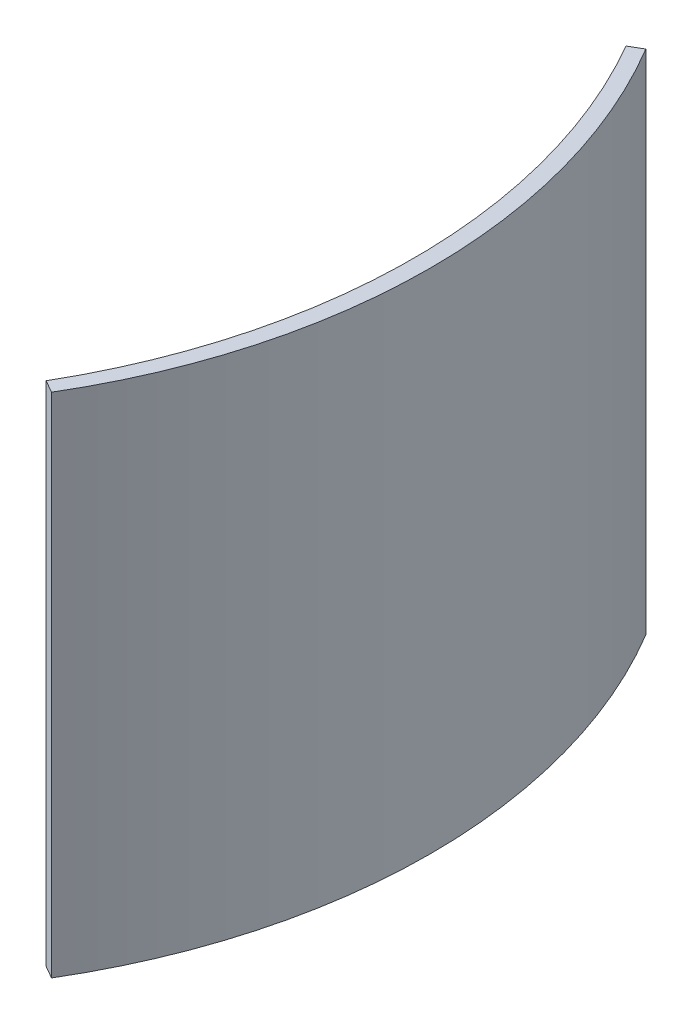
ISO-10303-21;
HEADER;
FILE_DESCRIPTION(('STEP AP214'),'2;1');
FILE_NAME('part.step','',(''),(''),'','','');
FILE_SCHEMA(('AUTOMOTIVE_DESIGN { 1 0 10303 214 1 1 1 1 }'));
ENDSEC;
DATA;
#1=APPLICATION_CONTEXT('core data for automotive mechanical design processes');
#2=APPLICATION_PROTOCOL_DEFINITION('international standard','automotive_design',2000,#1);
#3=PRODUCT_CONTEXT('',#1,'mechanical');
#4=PRODUCT('Part','Part','',(#3));
#5=PRODUCT_RELATED_PRODUCT_CATEGORY('part','',(#4));
#6=PRODUCT_DEFINITION_FORMATION('','',#4);
#7=PRODUCT_DEFINITION_CONTEXT('part definition',#1,'design');
#8=PRODUCT_DEFINITION('design','',#6,#7);
#9=PRODUCT_DEFINITION_SHAPE('','',#8);
#10=(LENGTH_UNIT() NAMED_UNIT(*) SI_UNIT(.MILLI.,.METRE.));
#11=(NAMED_UNIT(*) PLANE_ANGLE_UNIT() SI_UNIT($,.RADIAN.));
#12=(NAMED_UNIT(*) SI_UNIT($,.STERADIAN.) SOLID_ANGLE_UNIT());
#13=UNCERTAINTY_MEASURE_WITH_UNIT(LENGTH_MEASURE(1.E-05),#10,'distance_accuracy_value','');
#14=(GEOMETRIC_REPRESENTATION_CONTEXT(3) GLOBAL_UNCERTAINTY_ASSIGNED_CONTEXT((#13)) GLOBAL_UNIT_ASSIGNED_CONTEXT((#10,
#11,#12)) REPRESENTATION_CONTEXT('',''));
#15=CARTESIAN_POINT('',(0.,0.,0.));
#16=DIRECTION('',(0.,0.,1.));
#17=DIRECTION('',(1.,0.,0.));
#18=AXIS2_PLACEMENT_3D('',#15,#16,#17);
#19=CARTESIAN_POINT('',(-34.6410161513775,35.,20.));
#20=DIRECTION('',(0.,-1.,0.));
#21=DIRECTION('',(0.,0.,-1.));
#22=AXIS2_PLACEMENT_3D('',#19,#20,#21);
#23=CYLINDRICAL_SURFACE('',#22,40.);
#24=CARTESIAN_POINT('',(-34.6410161513775,0.,20.));
#25=DIRECTION('',(0.,-1.,0.));
#26=DIRECTION('',(0.,0.,-1.));
#27=AXIS2_PLACEMENT_3D('',#24,#25,#26);
#28=CIRCLE('',#27,40.);
#29=CARTESIAN_POINT('',(0.,0.,0.));
#30=VERTEX_POINT('',#29);
#31=CARTESIAN_POINT('',(0.,0.,40.));
#32=VERTEX_POINT('',#31);
#33=EDGE_CURVE('E95',#30,#32,#28,.T.);
#34=ORIENTED_EDGE('',*,*,#33,.T.);
#35=DIRECTION('',(0.,-1.,0.));
#36=VECTOR('',#35,1.);
#37=CARTESIAN_POINT('',(0.,35.,40.));
#38=LINE('',#37,#36);
#39=CARTESIAN_POINT('',(0.,35.,40.));
#40=VERTEX_POINT('',#39);
#41=EDGE_CURVE('E11',#40,#32,#38,.T.);
#42=ORIENTED_EDGE('',*,*,#41,.F.);
#43=CARTESIAN_POINT('',(-34.6410161513775,35.,20.));
#44=DIRECTION('',(0.,-1.,0.));
#45=DIRECTION('',(0.,0.,-1.));
#46=AXIS2_PLACEMENT_3D('',#43,#44,#45);
#47=CIRCLE('',#46,40.);
#48=CARTESIAN_POINT('',(0.,35.,0.));
#49=VERTEX_POINT('',#48);
#50=EDGE_CURVE('E83',#49,#40,#47,.T.);
#51=ORIENTED_EDGE('',*,*,#50,.F.);
#52=DIRECTION('',(0.,-1.,0.));
#53=VECTOR('',#52,1.);
#54=CARTESIAN_POINT('',(0.,35.,0.));
#55=LINE('',#54,#53);
#56=EDGE_CURVE('E91',#49,#30,#55,.T.);
#57=ORIENTED_EDGE('',*,*,#56,.T.);
#58=EDGE_LOOP('',(#34,#42,#51,#57));
#59=FACE_BOUND('',#58,.T.);
#60=ADVANCED_FACE('F32',(#59),#23,.F.);
#61=CARTESIAN_POINT('',(0.,35.,40.));
#62=DIRECTION('',(0.5,0.,-0.866025403784439));
#63=DIRECTION('',(-0.866025403784439,0.,-0.5));
#64=AXIS2_PLACEMENT_3D('',#61,#62,#63);
#65=PLANE('',#64);
#66=DIRECTION('',(0.866025403784439,0.,0.5));
#67=VECTOR('',#66,1.);
#68=CARTESIAN_POINT('',(0.,0.,40.));
#69=LINE('',#68,#67);
#70=CARTESIAN_POINT('',(0.866025403784443,0.,40.5));
#71=VERTEX_POINT('',#70);
#72=EDGE_CURVE('E87',#32,#71,#69,.T.);
#73=ORIENTED_EDGE('',*,*,#72,.T.);
#74=DIRECTION('',(0.,-1.,0.));
#75=VECTOR('',#74,1.);
#76=CARTESIAN_POINT('',(0.866025403784443,35.,40.5));
#77=LINE('',#76,#75);
#78=CARTESIAN_POINT('',(0.866025403784443,35.,40.5));
#79=VERTEX_POINT('',#78);
#80=EDGE_CURVE('E40',#79,#71,#77,.T.);
#81=ORIENTED_EDGE('',*,*,#80,.F.);
#82=DIRECTION('',(0.866025403784439,0.,0.5));
#83=VECTOR('',#82,1.);
#84=CARTESIAN_POINT('',(0.,35.,40.));
#85=LINE('',#84,#83);
#86=EDGE_CURVE('E78',#40,#79,#85,.T.);
#87=ORIENTED_EDGE('',*,*,#86,.F.);
#88=ORIENTED_EDGE('',*,*,#41,.T.);
#89=EDGE_LOOP('',(#73,#81,#87,#88));
#90=FACE_BOUND('',#89,.T.);
#91=ADVANCED_FACE('F86',(#90),#65,.F.);
#92=CARTESIAN_POINT('',(-33.4814635874068,35.,20.));
#93=DIRECTION('',(0.,-1.,0.));
#94=DIRECTION('',(0.,0.,-1.));
#95=AXIS2_PLACEMENT_3D('',#92,#93,#94);
#96=CYLINDRICAL_SURFACE('',#95,40.);
#97=CARTESIAN_POINT('',(-33.4814635874068,0.,20.));
#98=DIRECTION('',(0.,1.,0.));
#99=DIRECTION('',(0.,0.,-1.));
#100=AXIS2_PLACEMENT_3D('',#97,#98,#99);
#101=CIRCLE('',#100,40.);
#102=CARTESIAN_POINT('',(0.866025403784438,0.,-0.5));
#103=VERTEX_POINT('',#102);
#104=EDGE_CURVE('E65',#71,#103,#101,.T.);
#105=ORIENTED_EDGE('',*,*,#104,.T.);
#106=DIRECTION('',(0.,-1.,0.));
#107=VECTOR('',#106,1.);
#108=CARTESIAN_POINT('',(0.866025403784438,35.,-0.5));
#109=LINE('',#108,#107);
#110=CARTESIAN_POINT('',(0.866025403784438,35.,-0.5));
#111=VERTEX_POINT('',#110);
#112=EDGE_CURVE('E88',#111,#103,#109,.T.);
#113=ORIENTED_EDGE('',*,*,#112,.F.);
#114=CARTESIAN_POINT('',(-33.4814635874068,35.,20.));
#115=DIRECTION('',(0.,1.,0.));
#116=DIRECTION('',(0.,0.,-1.));
#117=AXIS2_PLACEMENT_3D('',#114,#115,#116);
#118=CIRCLE('',#117,40.);
#119=EDGE_CURVE('E81',#79,#111,#118,.T.);
#120=ORIENTED_EDGE('',*,*,#119,.F.);
#121=ORIENTED_EDGE('',*,*,#80,.T.);
#122=EDGE_LOOP('',(#105,#113,#120,#121));
#123=FACE_BOUND('',#122,.T.);
#124=ADVANCED_FACE('F89',(#123),#96,.T.);
#125=CARTESIAN_POINT('',(0.,35.,0.));
#126=DIRECTION('',(0.5,0.,0.866025403784438));
#127=DIRECTION('',(0.866025403784438,0.,-0.5));
#128=AXIS2_PLACEMENT_3D('',#125,#126,#127);
#129=PLANE('',#128);
#130=DIRECTION('',(-0.866025403784438,0.,0.5));
#131=VECTOR('',#130,1.);
#132=CARTESIAN_POINT('',(0.,0.,0.));
#133=LINE('',#132,#131);
#134=EDGE_CURVE('E71',#103,#30,#133,.T.);
#135=ORIENTED_EDGE('',*,*,#134,.T.);
#136=ORIENTED_EDGE('',*,*,#56,.F.);
#137=DIRECTION('',(-0.866025403784438,0.,0.5));
#138=VECTOR('',#137,1.);
#139=CARTESIAN_POINT('',(0.,35.,0.));
#140=LINE('',#139,#138);
#141=EDGE_CURVE('E48',#111,#49,#140,.T.);
#142=ORIENTED_EDGE('',*,*,#141,.F.);
#143=ORIENTED_EDGE('',*,*,#112,.T.);
#144=EDGE_LOOP('',(#135,#136,#142,#143));
#145=FACE_BOUND('',#144,.T.);
#146=ADVANCED_FACE('F102',(#145),#129,.F.);
#147=CARTESIAN_POINT('',(-34.6410161513775,35.,20.));
#148=DIRECTION('',(0.,-1.,0.));
#149=DIRECTION('',(0.,0.,-1.));
#150=AXIS2_PLACEMENT_3D('',#147,#148,#149);
#151=PLANE('',#150);
#152=ORIENTED_EDGE('',*,*,#50,.T.);
#153=ORIENTED_EDGE('',*,*,#86,.T.);
#154=ORIENTED_EDGE('',*,*,#119,.T.);
#155=ORIENTED_EDGE('',*,*,#141,.T.);
#156=EDGE_LOOP('',(#152,#153,#154,#155));
#157=FACE_BOUND('',#156,.T.);
#158=ADVANCED_FACE('F79',(#157),#151,.F.);
#159=CARTESIAN_POINT('',(-34.6410161513775,0.,20.));
#160=DIRECTION('',(0.,-1.,0.));
#161=DIRECTION('',(0.,0.,-1.));
#162=AXIS2_PLACEMENT_3D('',#159,#160,#161);
#163=PLANE('',#162);
#164=ORIENTED_EDGE('',*,*,#33,.F.);
#165=ORIENTED_EDGE('',*,*,#134,.F.);
#166=ORIENTED_EDGE('',*,*,#104,.F.);
#167=ORIENTED_EDGE('',*,*,#72,.F.);
#168=EDGE_LOOP('',(#164,#165,#166,#167));
#169=FACE_BOUND('',#168,.T.);
#170=ADVANCED_FACE('F105',(#169),#163,.T.);
#171=CLOSED_SHELL('',(#60,#91,#124,#146,#158,#170));
#172=MANIFOLD_SOLID_BREP('B2',#171);
#173=ADVANCED_BREP_SHAPE_REPRESENTATION('',(#18,#172),#14);
#174=SHAPE_DEFINITION_REPRESENTATION(#9,#173);
ENDSEC;
END-ISO-10303-21;
